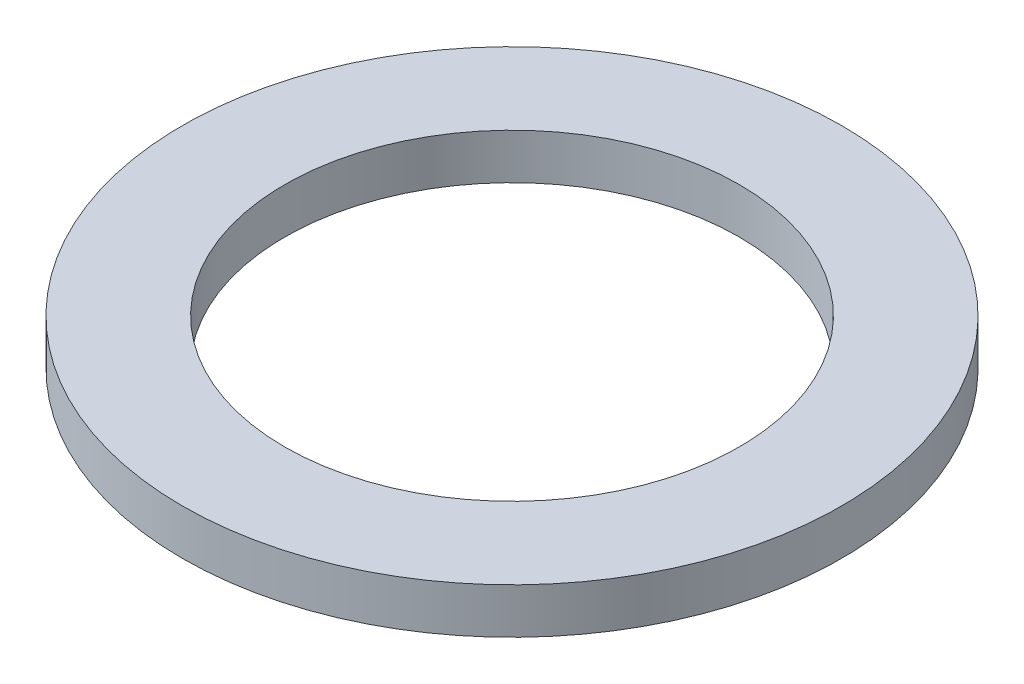
ISO-10303-21;
HEADER;
FILE_DESCRIPTION(('STEP AP214'),'2;1');
FILE_NAME('part.step','',(''),(''),'','','');
FILE_SCHEMA(('AUTOMOTIVE_DESIGN { 1 0 10303 214 1 1 1 1 }'));
ENDSEC;
DATA;
#1=APPLICATION_CONTEXT('core data for automotive mechanical design processes');
#2=APPLICATION_PROTOCOL_DEFINITION('international standard','automotive_design',2000,#1);
#3=PRODUCT_CONTEXT('',#1,'mechanical');
#4=PRODUCT('Part','Part','',(#3));
#5=PRODUCT_RELATED_PRODUCT_CATEGORY('part','',(#4));
#6=PRODUCT_DEFINITION_FORMATION('','',#4);
#7=PRODUCT_DEFINITION_CONTEXT('part definition',#1,'design');
#8=PRODUCT_DEFINITION('design','',#6,#7);
#9=PRODUCT_DEFINITION_SHAPE('','',#8);
#10=(LENGTH_UNIT() NAMED_UNIT(*) SI_UNIT(.MILLI.,.METRE.));
#11=(NAMED_UNIT(*) PLANE_ANGLE_UNIT() SI_UNIT($,.RADIAN.));
#12=(NAMED_UNIT(*) SI_UNIT($,.STERADIAN.) SOLID_ANGLE_UNIT());
#13=UNCERTAINTY_MEASURE_WITH_UNIT(LENGTH_MEASURE(1.E-05),#10,'distance_accuracy_value','');
#14=(GEOMETRIC_REPRESENTATION_CONTEXT(3) GLOBAL_UNCERTAINTY_ASSIGNED_CONTEXT((#13)) GLOBAL_UNIT_ASSIGNED_CONTEXT((#10,
#11,#12)) REPRESENTATION_CONTEXT('',''));
#15=CARTESIAN_POINT('',(0.,0.,0.));
#16=DIRECTION('',(0.,0.,1.));
#17=DIRECTION('',(1.,0.,0.));
#18=AXIS2_PLACEMENT_3D('',#15,#16,#17);
#19=CARTESIAN_POINT('',(0.,10.,0.));
#20=DIRECTION('',(0.,-1.,0.));
#21=DIRECTION('',(0.,0.,-1.));
#22=AXIS2_PLACEMENT_3D('',#19,#20,#21);
#23=CYLINDRICAL_SURFACE('',#22,72.5);
#24=CARTESIAN_POINT('',(0.,10.,0.));
#25=DIRECTION('',(0.,1.,0.));
#26=DIRECTION('',(0.,0.,1.));
#27=AXIS2_PLACEMENT_3D('',#24,#25,#26);
#28=CIRCLE('',#27,72.5);
#29=CARTESIAN_POINT('',(0.,10.,72.5));
#30=VERTEX_POINT('',#29);
#31=EDGE_CURVE('E10',#30,#30,#28,.T.);
#32=ORIENTED_EDGE('',*,*,#31,.F.);
#33=EDGE_LOOP('',(#32));
#34=FACE_BOUND('',#33,.T.);
#35=CARTESIAN_POINT('',(0.,0.,0.));
#36=DIRECTION('',(0.,1.,0.));
#37=DIRECTION('',(0.,0.,1.));
#38=AXIS2_PLACEMENT_3D('',#35,#36,#37);
#39=CIRCLE('',#38,72.5);
#40=CARTESIAN_POINT('',(0.,0.,72.5));
#41=VERTEX_POINT('',#40);
#42=EDGE_CURVE('E37',#41,#41,#39,.T.);
#43=ORIENTED_EDGE('',*,*,#42,.T.);
#44=EDGE_LOOP('',(#43));
#45=FACE_BOUND('',#44,.T.);
#46=ADVANCED_FACE('F40',(#34,#45),#23,.T.);
#47=CARTESIAN_POINT('',(0.,10.,0.));
#48=DIRECTION('',(0.,1.,0.));
#49=DIRECTION('',(0.,0.,1.));
#50=AXIS2_PLACEMENT_3D('',#47,#48,#49);
#51=PLANE('',#50);
#52=CARTESIAN_POINT('',(0.,10.,0.));
#53=DIRECTION('',(0.,1.,0.));
#54=DIRECTION('',(0.,0.,1.));
#55=AXIS2_PLACEMENT_3D('',#52,#53,#54);
#56=CIRCLE('',#55,50.);
#57=CARTESIAN_POINT('',(0.,10.,50.));
#58=VERTEX_POINT('',#57);
#59=EDGE_CURVE('E50',#58,#58,#56,.T.);
#60=ORIENTED_EDGE('',*,*,#59,.F.);
#61=EDGE_LOOP('',(#60));
#62=FACE_BOUND('',#61,.T.);
#63=ORIENTED_EDGE('',*,*,#31,.T.);
#64=EDGE_LOOP('',(#63));
#65=FACE_BOUND('',#64,.T.);
#66=ADVANCED_FACE('F59',(#62,#65),#51,.T.);
#67=CARTESIAN_POINT('',(0.,0.,0.));
#68=DIRECTION('',(0.,1.,0.));
#69=DIRECTION('',(0.,0.,1.));
#70=AXIS2_PLACEMENT_3D('',#67,#68,#69);
#71=PLANE('',#70);
#72=CARTESIAN_POINT('',(0.,0.,0.));
#73=DIRECTION('',(0.,1.,0.));
#74=DIRECTION('',(0.,0.,1.));
#75=AXIS2_PLACEMENT_3D('',#72,#73,#74);
#76=CIRCLE('',#75,50.);
#77=CARTESIAN_POINT('',(0.,0.,50.));
#78=VERTEX_POINT('',#77);
#79=EDGE_CURVE('E47',#78,#78,#76,.T.);
#80=ORIENTED_EDGE('',*,*,#79,.T.);
#81=EDGE_LOOP('',(#80));
#82=FACE_BOUND('',#81,.T.);
#83=ORIENTED_EDGE('',*,*,#42,.F.);
#84=EDGE_LOOP('',(#83));
#85=FACE_BOUND('',#84,.T.);
#86=ADVANCED_FACE('F58',(#82,#85),#71,.F.);
#87=CARTESIAN_POINT('',(0.,10.,0.));
#88=DIRECTION('',(0.,-1.,0.));
#89=DIRECTION('',(0.,0.,-1.));
#90=AXIS2_PLACEMENT_3D('',#87,#88,#89);
#91=CYLINDRICAL_SURFACE('',#90,50.);
#92=ORIENTED_EDGE('',*,*,#59,.T.);
#93=EDGE_LOOP('',(#92));
#94=FACE_BOUND('',#93,.T.);
#95=ORIENTED_EDGE('',*,*,#79,.F.);
#96=EDGE_LOOP('',(#95));
#97=FACE_BOUND('',#96,.T.);
#98=ADVANCED_FACE('F54',(#94,#97),#91,.F.);
#99=CLOSED_SHELL('',(#46,#66,#86,#98));
#100=MANIFOLD_SOLID_BREP('B2',#99);
#101=ADVANCED_BREP_SHAPE_REPRESENTATION('',(#18,#100),#14);
#102=SHAPE_DEFINITION_REPRESENTATION(#9,#101);
ENDSEC;
END-ISO-10303-21;
